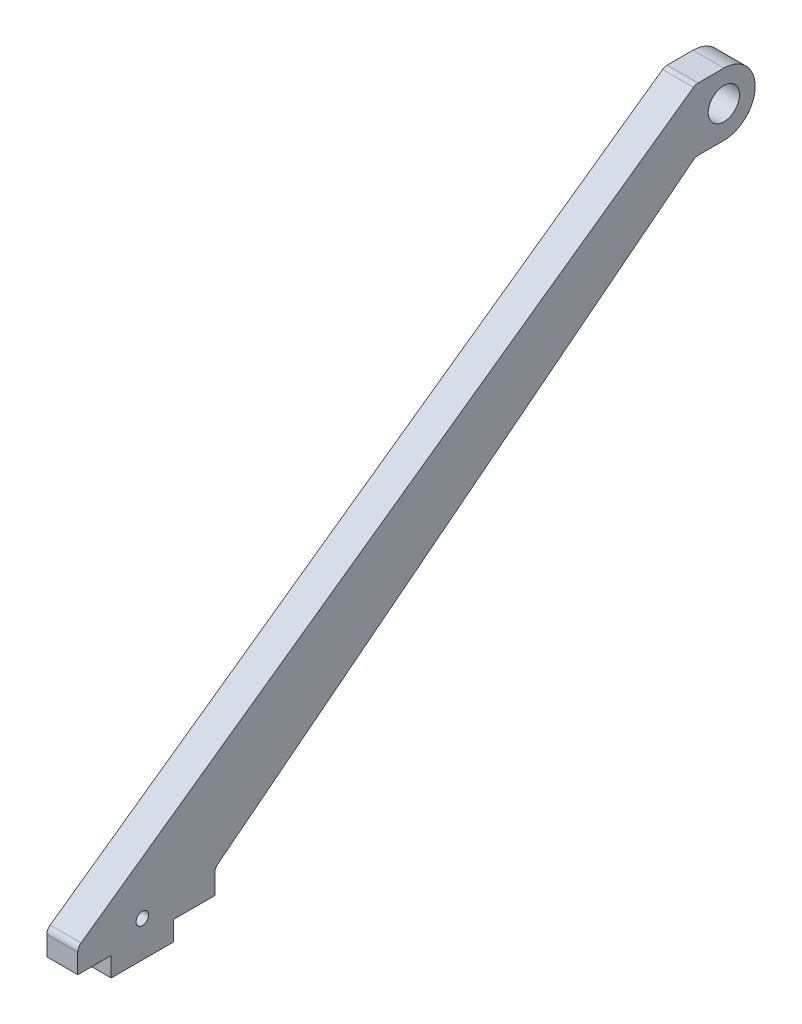
ISO-10303-21;
HEADER;
FILE_DESCRIPTION(('STEP AP214'),'2;1');
FILE_NAME('part.step','',(''),(''),'','','');
FILE_SCHEMA(('AUTOMOTIVE_DESIGN { 1 0 10303 214 1 1 1 1 }'));
ENDSEC;
DATA;
#1=APPLICATION_CONTEXT('core data for automotive mechanical design processes');
#2=APPLICATION_PROTOCOL_DEFINITION('international standard','automotive_design',2000,#1);
#3=PRODUCT_CONTEXT('',#1,'mechanical');
#4=PRODUCT('Part','Part','',(#3));
#5=PRODUCT_RELATED_PRODUCT_CATEGORY('part','',(#4));
#6=PRODUCT_DEFINITION_FORMATION('','',#4);
#7=PRODUCT_DEFINITION_CONTEXT('part definition',#1,'design');
#8=PRODUCT_DEFINITION('design','',#6,#7);
#9=PRODUCT_DEFINITION_SHAPE('','',#8);
#10=(LENGTH_UNIT() NAMED_UNIT(*) SI_UNIT(.MILLI.,.METRE.));
#11=(NAMED_UNIT(*) PLANE_ANGLE_UNIT() SI_UNIT($,.RADIAN.));
#12=(NAMED_UNIT(*) SI_UNIT($,.STERADIAN.) SOLID_ANGLE_UNIT());
#13=UNCERTAINTY_MEASURE_WITH_UNIT(LENGTH_MEASURE(1.E-05),#10,'distance_accuracy_value','');
#14=(GEOMETRIC_REPRESENTATION_CONTEXT(3) GLOBAL_UNCERTAINTY_ASSIGNED_CONTEXT((#13)) GLOBAL_UNIT_ASSIGNED_CONTEXT((#10,
#11,#12)) REPRESENTATION_CONTEXT('',''));
#15=CARTESIAN_POINT('',(0.,0.,0.));
#16=DIRECTION('',(0.,0.,1.));
#17=DIRECTION('',(1.,0.,0.));
#18=AXIS2_PLACEMENT_3D('',#15,#16,#17);
#19=CARTESIAN_POINT('',(7.9,1.98441657810762,-37.9609247580043));
#20=DIRECTION('',(0.,0.,1.));
#21=DIRECTION('',(0.,-1.,0.));
#22=AXIS2_PLACEMENT_3D('',#19,#20,#21);
#23=PLANE('',#22);
#24=DIRECTION('',(0.,1.,0.));
#25=VECTOR('',#24,1.);
#26=CARTESIAN_POINT('',(0.,1.98441657810762,-37.9609247580043));
#27=LINE('',#26,#25);
#28=CARTESIAN_POINT('',(0.,1.98441657810762,-37.9609247580043));
#29=VERTEX_POINT('',#28);
#30=CARTESIAN_POINT('',(0.,6.98441657810762,-37.9609247580043));
#31=VERTEX_POINT('',#30);
#32=EDGE_CURVE('E200',#29,#31,#27,.T.);
#33=ORIENTED_EDGE('',*,*,#32,.F.);
#34=DIRECTION('',(-1.,0.,0.));
#35=VECTOR('',#34,1.);
#36=CARTESIAN_POINT('',(7.9,1.98441657810762,-37.9609247580043));
#37=LINE('',#36,#35);
#38=CARTESIAN_POINT('',(7.9,1.98441657810762,-37.9609247580043));
#39=VERTEX_POINT('',#38);
#40=EDGE_CURVE('E168',#39,#29,#37,.T.);
#41=ORIENTED_EDGE('',*,*,#40,.F.);
#42=DIRECTION('',(0.,1.,0.));
#43=VECTOR('',#42,1.);
#44=CARTESIAN_POINT('',(7.9,1.98441657810762,-37.9609247580043));
#45=LINE('',#44,#43);
#46=CARTESIAN_POINT('',(7.9,6.98441657810762,-37.9609247580043));
#47=VERTEX_POINT('',#46);
#48=EDGE_CURVE('E164',#39,#47,#45,.T.);
#49=ORIENTED_EDGE('',*,*,#48,.T.);
#50=DIRECTION('',(-1.,0.,0.));
#51=VECTOR('',#50,1.);
#52=CARTESIAN_POINT('',(7.9,6.98441657810762,-37.9609247580043));
#53=LINE('',#52,#51);
#54=EDGE_CURVE('E148',#47,#31,#53,.T.);
#55=ORIENTED_EDGE('',*,*,#54,.T.);
#56=EDGE_LOOP('',(#33,#41,#49,#55));
#57=FACE_BOUND('',#56,.T.);
#58=ADVANCED_FACE('F33',(#57),#23,.T.);
#59=CARTESIAN_POINT('',(7.9,1.98441657810762,-37.9609247580043));
#60=DIRECTION('',(0.,1.,0.));
#61=DIRECTION('',(0.,0.,1.));
#62=AXIS2_PLACEMENT_3D('',#59,#60,#61);
#63=PLANE('',#62);
#64=DIRECTION('',(0.,0.,-1.));
#65=VECTOR('',#64,1.);
#66=CARTESIAN_POINT('',(0.,1.98441657810762,-37.9609247580043));
#67=LINE('',#66,#65);
#68=CARTESIAN_POINT('',(0.,1.98441657810762,-53.8609247580043));
#69=VERTEX_POINT('',#68);
#70=EDGE_CURVE('E170',#29,#69,#67,.T.);
#71=ORIENTED_EDGE('',*,*,#70,.T.);
#72=DIRECTION('',(-1.,0.,0.));
#73=VECTOR('',#72,1.);
#74=CARTESIAN_POINT('',(7.9,1.98441657810762,-53.8609247580043));
#75=LINE('',#74,#73);
#76=CARTESIAN_POINT('',(7.9,1.98441657810762,-53.8609247580043));
#77=VERTEX_POINT('',#76);
#78=EDGE_CURVE('E228',#77,#69,#75,.T.);
#79=ORIENTED_EDGE('',*,*,#78,.F.);
#80=DIRECTION('',(0.,0.,-1.));
#81=VECTOR('',#80,1.);
#82=CARTESIAN_POINT('',(7.9,1.98441657810762,-37.9609247580043));
#83=LINE('',#82,#81);
#84=EDGE_CURVE('E160',#39,#77,#83,.T.);
#85=ORIENTED_EDGE('',*,*,#84,.F.);
#86=ORIENTED_EDGE('',*,*,#40,.T.);
#87=EDGE_LOOP('',(#71,#79,#85,#86));
#88=FACE_BOUND('',#87,.T.);
#89=ADVANCED_FACE('F310',(#88),#63,.F.);
#90=CARTESIAN_POINT('',(7.9,1.98441657810762,-53.8609247580043));
#91=DIRECTION('',(0.,0.,1.));
#92=DIRECTION('',(1.,0.,0.));
#93=AXIS2_PLACEMENT_3D('',#90,#91,#92);
#94=PLANE('',#93);
#95=DIRECTION('',(0.,1.,0.));
#96=VECTOR('',#95,1.);
#97=CARTESIAN_POINT('',(0.,1.98441657810762,-53.8609247580043));
#98=LINE('',#97,#96);
#99=CARTESIAN_POINT('',(0.,6.98441657810762,-53.8609247580043));
#100=VERTEX_POINT('',#99);
#101=EDGE_CURVE('E172',#69,#100,#98,.T.);
#102=ORIENTED_EDGE('',*,*,#101,.T.);
#103=DIRECTION('',(-1.,0.,0.));
#104=VECTOR('',#103,1.);
#105=CARTESIAN_POINT('',(7.9,6.98441657810762,-53.8609247580043));
#106=LINE('',#105,#104);
#107=CARTESIAN_POINT('',(7.9,6.98441657810762,-53.8609247580043));
#108=VERTEX_POINT('',#107);
#109=EDGE_CURVE('E231',#108,#100,#106,.T.);
#110=ORIENTED_EDGE('',*,*,#109,.F.);
#111=DIRECTION('',(0.,1.,0.));
#112=VECTOR('',#111,1.);
#113=CARTESIAN_POINT('',(7.9,1.98441657810762,-53.8609247580043));
#114=LINE('',#113,#112);
#115=EDGE_CURVE('E197',#77,#108,#114,.T.);
#116=ORIENTED_EDGE('',*,*,#115,.F.);
#117=ORIENTED_EDGE('',*,*,#78,.T.);
#118=EDGE_LOOP('',(#102,#110,#116,#117));
#119=FACE_BOUND('',#118,.T.);
#120=ADVANCED_FACE('F313',(#119),#94,.F.);
#121=CARTESIAN_POINT('',(7.9,6.98441657810762,-53.8609247580043));
#122=DIRECTION('',(0.,1.,0.));
#123=DIRECTION('',(0.,0.,1.));
#124=AXIS2_PLACEMENT_3D('',#121,#122,#123);
#125=PLANE('',#124);
#126=DIRECTION('',(0.,0.,-1.));
#127=VECTOR('',#126,1.);
#128=CARTESIAN_POINT('',(0.,6.98441657810762,-53.8609247580043));
#129=LINE('',#128,#127);
#130=CARTESIAN_POINT('',(0.,6.98441657810762,-64.4109247580044));
#131=VERTEX_POINT('',#130);
#132=EDGE_CURVE('E223',#100,#131,#129,.T.);
#133=ORIENTED_EDGE('',*,*,#132,.T.);
#134=DIRECTION('',(-1.,0.,0.));
#135=VECTOR('',#134,1.);
#136=CARTESIAN_POINT('',(7.9,6.98441657810762,-64.4109247580044));
#137=LINE('',#136,#135);
#138=CARTESIAN_POINT('',(7.9,6.98441657810762,-64.4109247580044));
#139=VERTEX_POINT('',#138);
#140=EDGE_CURVE('E234',#139,#131,#137,.T.);
#141=ORIENTED_EDGE('',*,*,#140,.F.);
#142=DIRECTION('',(0.,0.,-1.));
#143=VECTOR('',#142,1.);
#144=CARTESIAN_POINT('',(7.9,6.98441657810762,-53.8609247580043));
#145=LINE('',#144,#143);
#146=EDGE_CURVE('E195',#108,#139,#145,.T.);
#147=ORIENTED_EDGE('',*,*,#146,.F.);
#148=ORIENTED_EDGE('',*,*,#109,.T.);
#149=EDGE_LOOP('',(#133,#141,#147,#148));
#150=FACE_BOUND('',#149,.T.);
#151=ADVANCED_FACE('F320',(#150),#125,.F.);
#152=CARTESIAN_POINT('',(7.9,6.98441657810762,-64.4109247580044));
#153=DIRECTION('',(0.,0.,1.));
#154=DIRECTION('',(1.,0.,0.));
#155=AXIS2_PLACEMENT_3D('',#152,#153,#154);
#156=PLANE('',#155);
#157=DIRECTION('',(0.,1.,0.));
#158=VECTOR('',#157,1.);
#159=CARTESIAN_POINT('',(0.,6.98441657810762,-64.4109247580044));
#160=LINE('',#159,#158);
#161=CARTESIAN_POINT('',(0.,12.0094883647217,-64.4109247580044));
#162=VERTEX_POINT('',#161);
#163=EDGE_CURVE('E220',#131,#162,#160,.T.);
#164=ORIENTED_EDGE('',*,*,#163,.T.);
#165=DIRECTION('',(-1.,0.,0.));
#166=VECTOR('',#165,1.);
#167=CARTESIAN_POINT('',(7.9,12.0094883647217,-64.4109247580044));
#168=LINE('',#167,#166);
#169=CARTESIAN_POINT('',(7.9,12.0094883647217,-64.4109247580044));
#170=VERTEX_POINT('',#169);
#171=EDGE_CURVE('E246',#162,#170,#168,.F.);
#172=ORIENTED_EDGE('',*,*,#171,.T.);
#173=DIRECTION('',(0.,1.,0.));
#174=VECTOR('',#173,1.);
#175=CARTESIAN_POINT('',(7.9,6.98441657810762,-64.4109247580044));
#176=LINE('',#175,#174);
#177=EDGE_CURVE('E192',#139,#170,#176,.T.);
#178=ORIENTED_EDGE('',*,*,#177,.F.);
#179=ORIENTED_EDGE('',*,*,#140,.T.);
#180=EDGE_LOOP('',(#164,#172,#178,#179));
#181=FACE_BOUND('',#180,.T.);
#182=ADVANCED_FACE('F323',(#181),#156,.F.);
#183=CARTESIAN_POINT('',(7.9,12.9844165781076,-64.4109247580044));
#184=DIRECTION('',(0.,0.787743592152993,0.616003273548038));
#185=DIRECTION('',(0.,-0.616003273548038,0.787743592152993));
#186=AXIS2_PLACEMENT_3D('',#183,#184,#185);
#187=PLANE('',#186);
#188=DIRECTION('',(0.,0.616003273548038,-0.787743592152993));
#189=VECTOR('',#188,1.);
#190=CARTESIAN_POINT('',(7.9,12.9844165781076,-64.4109247580044));
#191=LINE('',#190,#189);
#192=CARTESIAN_POINT('',(7.9,13.5849755490277,-65.1789182109083));
#193=VERTEX_POINT('',#192);
#194=CARTESIAN_POINT('',(7.9,108.559903762414,-186.632641475012));
#195=VERTEX_POINT('',#194);
#196=EDGE_CURVE('E189',#193,#195,#191,.T.);
#197=ORIENTED_EDGE('',*,*,#196,.F.);
#198=DIRECTION('',(-1.,0.,0.));
#199=VECTOR('',#198,1.);
#200=CARTESIAN_POINT('',(0.,13.5849755490277,-65.1789182109083));
#201=LINE('',#200,#199);
#202=CARTESIAN_POINT('',(0.,13.5849755490277,-65.1789182109083));
#203=VERTEX_POINT('',#202);
#204=EDGE_CURVE('E243',#193,#203,#201,.T.);
#205=ORIENTED_EDGE('',*,*,#204,.T.);
#206=DIRECTION('',(0.,0.616003273548038,-0.787743592152993));
#207=VECTOR('',#206,1.);
#208=CARTESIAN_POINT('',(0.,12.9844165781076,-64.4109247580044));
#209=LINE('',#208,#207);
#210=CARTESIAN_POINT('',(0.,108.559903762414,-186.632641475012));
#211=VERTEX_POINT('',#210);
#212=EDGE_CURVE('E217',#203,#211,#209,.T.);
#213=ORIENTED_EDGE('',*,*,#212,.T.);
#214=DIRECTION('',(-1.,0.,0.));
#215=VECTOR('',#214,1.);
#216=CARTESIAN_POINT('',(7.9,108.559903762414,-186.632641475012));
#217=LINE('',#216,#215);
#218=EDGE_CURVE('E227',#211,#195,#217,.F.);
#219=ORIENTED_EDGE('',*,*,#218,.T.);
#220=EDGE_LOOP('',(#197,#205,#213,#219));
#221=FACE_BOUND('',#220,.T.);
#222=ADVANCED_FACE('F280',(#221),#187,.F.);
#223=CARTESIAN_POINT('',(7.9,108.984416578108,-194.410924758004));
#224=DIRECTION('',(0.,-1.,0.));
#225=DIRECTION('',(0.,0.,-1.));
#226=AXIS2_PLACEMENT_3D('',#223,#224,#225);
#227=PLANE('',#226);
#228=DIRECTION('',(0.,0.,1.));
#229=VECTOR('',#228,1.);
#230=CARTESIAN_POINT('',(7.9,108.984416578108,-194.410924758004));
#231=LINE('',#230,#229);
#232=CARTESIAN_POINT('',(7.9,108.984416578108,-194.410924758004));
#233=VERTEX_POINT('',#232);
#234=CARTESIAN_POINT('',(7.9,108.984416578108,-187.864648022108));
#235=VERTEX_POINT('',#234);
#236=EDGE_CURVE('E186',#233,#235,#231,.T.);
#237=ORIENTED_EDGE('',*,*,#236,.T.);
#238=DIRECTION('',(-1.,0.,0.));
#239=VECTOR('',#238,1.);
#240=CARTESIAN_POINT('',(7.9,108.984416578108,-187.864648022108));
#241=LINE('',#240,#239);
#242=CARTESIAN_POINT('',(0.,108.984416578108,-187.864648022108));
#243=VERTEX_POINT('',#242);
#244=EDGE_CURVE('E248',#235,#243,#241,.T.);
#245=ORIENTED_EDGE('',*,*,#244,.T.);
#246=DIRECTION('',(0.,0.,1.));
#247=VECTOR('',#246,1.);
#248=CARTESIAN_POINT('',(0.,108.984416578108,-194.410924758004));
#249=LINE('',#248,#247);
#250=CARTESIAN_POINT('',(0.,108.984416578108,-194.410924758004));
#251=VERTEX_POINT('',#250);
#252=EDGE_CURVE('E214',#251,#243,#249,.T.);
#253=ORIENTED_EDGE('',*,*,#252,.F.);
#254=DIRECTION('',(-1.,0.,0.));
#255=VECTOR('',#254,1.);
#256=CARTESIAN_POINT('',(7.9,108.984416578108,-194.410924758004));
#257=LINE('',#256,#255);
#258=EDGE_CURVE('E237',#233,#251,#257,.T.);
#259=ORIENTED_EDGE('',*,*,#258,.F.);
#260=EDGE_LOOP('',(#237,#245,#253,#259));
#261=FACE_BOUND('',#260,.T.);
#262=ADVANCED_FACE('F287',(#261),#227,.T.);
#263=CARTESIAN_POINT('',(7.9,116.984416578108,-194.410924758004));
#264=DIRECTION('',(-1.,0.,0.));
#265=DIRECTION('',(0.,0.,1.));
#266=AXIS2_PLACEMENT_3D('',#263,#264,#265);
#267=CYLINDRICAL_SURFACE('',#266,8.);
#268=CARTESIAN_POINT('',(0.,116.984416578108,-194.410924758004));
#269=DIRECTION('',(-1.,0.,0.));
#270=DIRECTION('',(0.,0.,1.));
#271=AXIS2_PLACEMENT_3D('',#268,#269,#270);
#272=CIRCLE('',#271,8.);
#273=CARTESIAN_POINT('',(0.,124.984416578108,-194.410924758004));
#274=VERTEX_POINT('',#273);
#275=EDGE_CURVE('E211',#274,#251,#272,.T.);
#276=ORIENTED_EDGE('',*,*,#275,.F.);
#277=DIRECTION('',(-1.,0.,0.));
#278=VECTOR('',#277,1.);
#279=CARTESIAN_POINT('',(7.9,124.984416578108,-194.410924758004));
#280=LINE('',#279,#278);
#281=CARTESIAN_POINT('',(7.9,124.984416578108,-194.410924758004));
#282=VERTEX_POINT('',#281);
#283=EDGE_CURVE('E239',#282,#274,#280,.T.);
#284=ORIENTED_EDGE('',*,*,#283,.F.);
#285=CARTESIAN_POINT('',(7.9,116.984416578108,-194.410924758004));
#286=DIRECTION('',(-1.,0.,0.));
#287=DIRECTION('',(0.,0.,1.));
#288=AXIS2_PLACEMENT_3D('',#285,#286,#287);
#289=CIRCLE('',#288,8.);
#290=EDGE_CURVE('E183',#282,#233,#289,.T.);
#291=ORIENTED_EDGE('',*,*,#290,.T.);
#292=ORIENTED_EDGE('',*,*,#258,.T.);
#293=EDGE_LOOP('',(#276,#284,#291,#292));
#294=FACE_BOUND('',#293,.T.);
#295=ADVANCED_FACE('F290',(#294),#267,.T.);
#296=CARTESIAN_POINT('',(7.9,124.984416578108,-194.410924758004));
#297=DIRECTION('',(0.,-1.,0.));
#298=DIRECTION('',(0.,0.,-1.));
#299=AXIS2_PLACEMENT_3D('',#296,#297,#298);
#300=PLANE('',#299);
#301=DIRECTION('',(0.,0.,1.));
#302=VECTOR('',#301,1.);
#303=CARTESIAN_POINT('',(0.,124.984416578108,-194.410924758004));
#304=LINE('',#303,#302);
#305=CARTESIAN_POINT('',(0.,124.984416578108,-187.81324373198));
#306=VERTEX_POINT('',#305);
#307=EDGE_CURVE('E209',#274,#306,#304,.T.);
#308=ORIENTED_EDGE('',*,*,#307,.T.);
#309=DIRECTION('',(-1.,0.,0.));
#310=VECTOR('',#309,1.);
#311=CARTESIAN_POINT('',(7.9,124.984416578108,-187.81324373198));
#312=LINE('',#311,#310);
#313=CARTESIAN_POINT('',(7.9,124.984416578108,-187.81324373198));
#314=VERTEX_POINT('',#313);
#315=EDGE_CURVE('E56',#306,#314,#312,.F.);
#316=ORIENTED_EDGE('',*,*,#315,.T.);
#317=DIRECTION('',(0.,0.,1.));
#318=VECTOR('',#317,1.);
#319=CARTESIAN_POINT('',(7.9,124.984416578108,-194.410924758004));
#320=LINE('',#319,#318);
#321=EDGE_CURVE('E181',#282,#314,#320,.T.);
#322=ORIENTED_EDGE('',*,*,#321,.F.);
#323=ORIENTED_EDGE('',*,*,#283,.T.);
#324=EDGE_LOOP('',(#308,#316,#322,#323));
#325=FACE_BOUND('',#324,.T.);
#326=ADVANCED_FACE('F351',(#325),#300,.F.);
#327=CARTESIAN_POINT('',(7.9,124.984416578108,-187.175507503018));
#328=DIRECTION('',(0.,-0.815414343729439,-0.578877748786641));
#329=DIRECTION('',(0.,0.578877748786641,-0.815414343729439));
#330=AXIS2_PLACEMENT_3D('',#327,#328,#329);
#331=PLANE('',#330);
#332=DIRECTION('',(0.,-0.578877748786641,0.815414343729439));
#333=VECTOR('',#332,1.);
#334=CARTESIAN_POINT('',(7.9,124.984416578108,-187.175507503018));
#335=LINE('',#334,#333);
#336=CARTESIAN_POINT('',(7.9,124.615245265567,-186.655488234406));
#337=VERTEX_POINT('',#336);
#338=CARTESIAN_POINT('',(7.9,13.5823415536026,-30.253169260431));
#339=VERTEX_POINT('',#338);
#340=EDGE_CURVE('E179',#337,#339,#335,.T.);
#341=ORIENTED_EDGE('',*,*,#340,.F.);
#342=DIRECTION('',(-1.,0.,0.));
#343=VECTOR('',#342,1.);
#344=CARTESIAN_POINT('',(7.9,124.615245265567,-186.655488234406));
#345=LINE('',#344,#343);
#346=CARTESIAN_POINT('',(0.,124.615245265567,-186.655488234406));
#347=VERTEX_POINT('',#346);
#348=EDGE_CURVE('E253',#337,#347,#345,.T.);
#349=ORIENTED_EDGE('',*,*,#348,.T.);
#350=DIRECTION('',(0.,-0.578877748786641,0.815414343729439));
#351=VECTOR('',#350,1.);
#352=CARTESIAN_POINT('',(0.,124.984416578108,-187.175507503018));
#353=LINE('',#352,#351);
#354=CARTESIAN_POINT('',(0.,13.5823415536026,-30.253169260431));
#355=VERTEX_POINT('',#354);
#356=EDGE_CURVE('E206',#347,#355,#353,.T.);
#357=ORIENTED_EDGE('',*,*,#356,.T.);
#358=DIRECTION('',(-1.,0.,0.));
#359=VECTOR('',#358,1.);
#360=CARTESIAN_POINT('',(7.9,13.5823415536026,-30.253169260431));
#361=LINE('',#360,#359);
#362=EDGE_CURVE('E251',#355,#339,#361,.F.);
#363=ORIENTED_EDGE('',*,*,#362,.T.);
#364=EDGE_LOOP('',(#341,#349,#357,#363));
#365=FACE_BOUND('',#364,.T.);
#366=ADVANCED_FACE('F297',(#365),#331,.F.);
#367=CARTESIAN_POINT('',(7.9,12.9844165781076,-29.4109247580043));
#368=DIRECTION('',(0.,0.,-1.));
#369=DIRECTION('',(-1.,0.,0.));
#370=AXIS2_PLACEMENT_3D('',#367,#368,#369);
#371=PLANE('',#370);
#372=DIRECTION('',(0.,-1.,0.));
#373=VECTOR('',#372,1.);
#374=CARTESIAN_POINT('',(7.9,12.9844165781076,-29.4109247580043));
#375=LINE('',#374,#373);
#376=CARTESIAN_POINT('',(7.9,11.9515128661438,-29.4109247580043));
#377=VERTEX_POINT('',#376);
#378=CARTESIAN_POINT('',(7.9,6.98441657810762,-29.4109247580043));
#379=VERTEX_POINT('',#378);
#380=EDGE_CURVE('E165',#377,#379,#375,.T.);
#381=ORIENTED_EDGE('',*,*,#380,.F.);
#382=DIRECTION('',(-1.,0.,0.));
#383=VECTOR('',#382,1.);
#384=CARTESIAN_POINT('',(7.9,11.9515128661438,-29.4109247580043));
#385=LINE('',#384,#383);
#386=CARTESIAN_POINT('',(0.,11.9515128661438,-29.4109247580043));
#387=VERTEX_POINT('',#386);
#388=EDGE_CURVE('E264',#377,#387,#385,.T.);
#389=ORIENTED_EDGE('',*,*,#388,.T.);
#390=DIRECTION('',(0.,-1.,0.));
#391=VECTOR('',#390,1.);
#392=CARTESIAN_POINT('',(0.,12.9844165781076,-29.4109247580043));
#393=LINE('',#392,#391);
#394=CARTESIAN_POINT('',(0.,6.98441657810762,-29.4109247580043));
#395=VERTEX_POINT('',#394);
#396=EDGE_CURVE('E204',#387,#395,#393,.T.);
#397=ORIENTED_EDGE('',*,*,#396,.T.);
#398=DIRECTION('',(-1.,0.,0.));
#399=VECTOR('',#398,1.);
#400=CARTESIAN_POINT('',(7.9,6.98441657810762,-29.4109247580043));
#401=LINE('',#400,#399);
#402=EDGE_CURVE('E159',#379,#395,#401,.T.);
#403=ORIENTED_EDGE('',*,*,#402,.F.);
#404=EDGE_LOOP('',(#381,#389,#397,#403));
#405=FACE_BOUND('',#404,.T.);
#406=ADVANCED_FACE('F304',(#405),#371,.F.);
#407=CARTESIAN_POINT('',(7.9,6.98441657810762,-37.9609247580043));
#408=DIRECTION('',(0.,-1.,0.));
#409=DIRECTION('',(0.,0.,-1.));
#410=AXIS2_PLACEMENT_3D('',#407,#408,#409);
#411=PLANE('',#410);
#412=DIRECTION('',(0.,0.,1.));
#413=VECTOR('',#412,1.);
#414=CARTESIAN_POINT('',(0.,6.98441657810762,-37.9609247580043));
#415=LINE('',#414,#413);
#416=EDGE_CURVE('E154',#31,#395,#415,.T.);
#417=ORIENTED_EDGE('',*,*,#416,.F.);
#418=ORIENTED_EDGE('',*,*,#54,.F.);
#419=DIRECTION('',(0.,0.,1.));
#420=VECTOR('',#419,1.);
#421=CARTESIAN_POINT('',(7.9,6.98441657810762,-37.9609247580043));
#422=LINE('',#421,#420);
#423=EDGE_CURVE('E152',#47,#379,#422,.T.);
#424=ORIENTED_EDGE('',*,*,#423,.T.);
#425=ORIENTED_EDGE('',*,*,#402,.T.);
#426=EDGE_LOOP('',(#417,#418,#424,#425));
#427=FACE_BOUND('',#426,.T.);
#428=ADVANCED_FACE('F150',(#427),#411,.T.);
#429=CARTESIAN_POINT('',(7.9,116.984416578108,-194.410924758004));
#430=DIRECTION('',(-1.,0.,0.));
#431=DIRECTION('',(0.,0.,1.));
#432=AXIS2_PLACEMENT_3D('',#429,#430,#431);
#433=PLANE('',#432);
#434=CARTESIAN_POINT('',(7.9,117.118890011223,-194.410924758004));
#435=DIRECTION('',(1.,0.,0.));
#436=DIRECTION('',(0.,0.,-1.));
#437=AXIS2_PLACEMENT_3D('',#434,#435,#436);
#438=CIRCLE('',#437,3.99999999999999);
#439=CARTESIAN_POINT('',(7.9,117.118890011223,-198.410924758004));
#440=VERTEX_POINT('',#439);
#441=EDGE_CURVE('E384',#440,#440,#438,.T.);
#442=ORIENTED_EDGE('',*,*,#441,.F.);
#443=EDGE_LOOP('',(#442));
#444=FACE_BOUND('',#443,.T.);
#445=CARTESIAN_POINT('',(7.9,11.1844165781076,-45.9109247580044));
#446=DIRECTION('',(1.,0.,0.));
#447=DIRECTION('',(0.,0.,-1.));
#448=AXIS2_PLACEMENT_3D('',#445,#446,#447);
#449=CIRCLE('',#448,1.6);
#450=CARTESIAN_POINT('',(7.9,11.1844165781076,-47.5109247580044));
#451=VERTEX_POINT('',#450);
#452=EDGE_CURVE('E175',#451,#451,#449,.T.);
#453=ORIENTED_EDGE('',*,*,#452,.F.);
#454=EDGE_LOOP('',(#453));
#455=FACE_BOUND('',#454,.T.);
#456=ORIENTED_EDGE('',*,*,#321,.T.);
#457=CARTESIAN_POINT('',(7.9,122.984416578108,-187.81324373198));
#458=DIRECTION('',(-1.,0.,0.));
#459=DIRECTION('',(0.,0.,1.));
#460=AXIS2_PLACEMENT_3D('',#457,#458,#459);
#461=CIRCLE('',#460,2.);
#462=EDGE_CURVE('E262',#314,#337,#461,.F.);
#463=ORIENTED_EDGE('',*,*,#462,.T.);
#464=ORIENTED_EDGE('',*,*,#340,.T.);
#465=CARTESIAN_POINT('',(7.9,11.9515128661438,-31.4109247580043));
#466=DIRECTION('',(-1.,0.,0.));
#467=DIRECTION('',(0.,0.,1.));
#468=AXIS2_PLACEMENT_3D('',#465,#466,#467);
#469=CIRCLE('',#468,2.);
#470=EDGE_CURVE('E48',#339,#377,#469,.F.);
#471=ORIENTED_EDGE('',*,*,#470,.T.);
#472=ORIENTED_EDGE('',*,*,#380,.T.);
#473=ORIENTED_EDGE('',*,*,#423,.F.);
#474=ORIENTED_EDGE('',*,*,#48,.F.);
#475=ORIENTED_EDGE('',*,*,#84,.T.);
#476=ORIENTED_EDGE('',*,*,#115,.T.);
#477=ORIENTED_EDGE('',*,*,#146,.T.);
#478=ORIENTED_EDGE('',*,*,#177,.T.);
#479=CARTESIAN_POINT('',(7.9,12.0094883647217,-66.4109247580044));
#480=DIRECTION('',(-1.,0.,0.));
#481=DIRECTION('',(0.,0.,1.));
#482=AXIS2_PLACEMENT_3D('',#479,#480,#481);
#483=CIRCLE('',#482,2.);
#484=EDGE_CURVE('E269',#170,#193,#483,.T.);
#485=ORIENTED_EDGE('',*,*,#484,.T.);
#486=ORIENTED_EDGE('',*,*,#196,.T.);
#487=CARTESIAN_POINT('',(7.9,106.984416578108,-187.864648022108));
#488=DIRECTION('',(-1.,0.,0.));
#489=DIRECTION('',(0.,0.,1.));
#490=AXIS2_PLACEMENT_3D('',#487,#488,#489);
#491=CIRCLE('',#490,2.);
#492=EDGE_CURVE('E11',#195,#235,#491,.T.);
#493=ORIENTED_EDGE('',*,*,#492,.T.);
#494=ORIENTED_EDGE('',*,*,#236,.F.);
#495=ORIENTED_EDGE('',*,*,#290,.F.);
#496=EDGE_LOOP('',(#456,#463,#464,#471,#472,#473,#474,#475,#476,#477,#478,#485,#486,#493,#494,#495));
#497=FACE_BOUND('',#496,.T.);
#498=ADVANCED_FACE('F163',(#444,#455,#497),#433,.F.);
#499=CARTESIAN_POINT('',(0.,116.984416578108,-194.410924758004));
#500=DIRECTION('',(-1.,0.,0.));
#501=DIRECTION('',(0.,0.,1.));
#502=AXIS2_PLACEMENT_3D('',#499,#500,#501);
#503=PLANE('',#502);
#504=CARTESIAN_POINT('',(0.,117.118890011223,-194.410924758004));
#505=DIRECTION('',(1.,0.,0.));
#506=DIRECTION('',(0.,0.,-1.));
#507=AXIS2_PLACEMENT_3D('',#504,#505,#506);
#508=CIRCLE('',#507,3.99999999999999);
#509=CARTESIAN_POINT('',(0.,117.118890011223,-198.410924758004));
#510=VERTEX_POINT('',#509);
#511=EDGE_CURVE('E382',#510,#510,#508,.T.);
#512=ORIENTED_EDGE('',*,*,#511,.T.);
#513=EDGE_LOOP('',(#512));
#514=FACE_BOUND('',#513,.T.);
#515=CARTESIAN_POINT('',(0.,11.1844165781076,-45.9109247580044));
#516=DIRECTION('',(1.,0.,0.));
#517=DIRECTION('',(0.,0.,-1.));
#518=AXIS2_PLACEMENT_3D('',#515,#516,#517);
#519=CIRCLE('',#518,1.6);
#520=CARTESIAN_POINT('',(0.,11.1844165781076,-47.5109247580044));
#521=VERTEX_POINT('',#520);
#522=EDGE_CURVE('E202',#521,#521,#519,.T.);
#523=ORIENTED_EDGE('',*,*,#522,.T.);
#524=EDGE_LOOP('',(#523));
#525=FACE_BOUND('',#524,.T.);
#526=ORIENTED_EDGE('',*,*,#356,.F.);
#527=CARTESIAN_POINT('',(0.,122.984416578108,-187.81324373198));
#528=DIRECTION('',(-1.,0.,0.));
#529=DIRECTION('',(0.,0.,1.));
#530=AXIS2_PLACEMENT_3D('',#527,#528,#529);
#531=CIRCLE('',#530,2.);
#532=EDGE_CURVE('E258',#347,#306,#531,.T.);
#533=ORIENTED_EDGE('',*,*,#532,.T.);
#534=ORIENTED_EDGE('',*,*,#307,.F.);
#535=ORIENTED_EDGE('',*,*,#275,.T.);
#536=ORIENTED_EDGE('',*,*,#252,.T.);
#537=CARTESIAN_POINT('',(0.,106.984416578108,-187.864648022108));
#538=DIRECTION('',(-1.,0.,0.));
#539=DIRECTION('',(0.,0.,1.));
#540=AXIS2_PLACEMENT_3D('',#537,#538,#539);
#541=CIRCLE('',#540,2.);
#542=EDGE_CURVE('E41',#243,#211,#541,.F.);
#543=ORIENTED_EDGE('',*,*,#542,.T.);
#544=ORIENTED_EDGE('',*,*,#212,.F.);
#545=CARTESIAN_POINT('',(0.,12.0094883647217,-66.4109247580044));
#546=DIRECTION('',(-1.,0.,0.));
#547=DIRECTION('',(0.,0.,1.));
#548=AXIS2_PLACEMENT_3D('',#545,#546,#547);
#549=CIRCLE('',#548,2.);
#550=EDGE_CURVE('E267',#203,#162,#549,.F.);
#551=ORIENTED_EDGE('',*,*,#550,.T.);
#552=ORIENTED_EDGE('',*,*,#163,.F.);
#553=ORIENTED_EDGE('',*,*,#132,.F.);
#554=ORIENTED_EDGE('',*,*,#101,.F.);
#555=ORIENTED_EDGE('',*,*,#70,.F.);
#556=ORIENTED_EDGE('',*,*,#32,.T.);
#557=ORIENTED_EDGE('',*,*,#416,.T.);
#558=ORIENTED_EDGE('',*,*,#396,.F.);
#559=CARTESIAN_POINT('',(0.,11.9515128661438,-31.4109247580043));
#560=DIRECTION('',(-1.,0.,0.));
#561=DIRECTION('',(0.,0.,1.));
#562=AXIS2_PLACEMENT_3D('',#559,#560,#561);
#563=CIRCLE('',#562,2.);
#564=EDGE_CURVE('E256',#387,#355,#563,.T.);
#565=ORIENTED_EDGE('',*,*,#564,.T.);
#566=EDGE_LOOP('',(#526,#533,#534,#535,#536,#543,#544,#551,#552,#553,#554,#555,#556,#557,#558,#565));
#567=FACE_BOUND('',#566,.T.);
#568=ADVANCED_FACE('F273',(#514,#525,#567),#503,.T.);
#569=CARTESIAN_POINT('',(0.,11.1844165781076,-45.9109247580044));
#570=DIRECTION('',(1.,0.,0.));
#571=DIRECTION('',(0.,0.,-1.));
#572=AXIS2_PLACEMENT_3D('',#569,#570,#571);
#573=CYLINDRICAL_SURFACE('',#572,1.6);
#574=ORIENTED_EDGE('',*,*,#522,.F.);
#575=EDGE_LOOP('',(#574));
#576=FACE_BOUND('',#575,.T.);
#577=ORIENTED_EDGE('',*,*,#452,.T.);
#578=EDGE_LOOP('',(#577));
#579=FACE_BOUND('',#578,.T.);
#580=ADVANCED_FACE('F335',(#576,#579),#573,.F.);
#581=CARTESIAN_POINT('',(0.,117.118890011223,-194.410924758004));
#582=DIRECTION('',(1.,0.,0.));
#583=DIRECTION('',(0.,0.,-1.));
#584=AXIS2_PLACEMENT_3D('',#581,#582,#583);
#585=CYLINDRICAL_SURFACE('',#584,3.99999999999999);
#586=ORIENTED_EDGE('',*,*,#511,.F.);
#587=EDGE_LOOP('',(#586));
#588=FACE_BOUND('',#587,.T.);
#589=ORIENTED_EDGE('',*,*,#441,.T.);
#590=EDGE_LOOP('',(#589));
#591=FACE_BOUND('',#590,.T.);
#592=ADVANCED_FACE('F328',(#588,#591),#585,.F.);
#593=CARTESIAN_POINT('',(7.9,12.0094883647217,-66.4109247580044));
#594=DIRECTION('',(1.,0.,0.));
#595=DIRECTION('',(0.,0.,-1.));
#596=AXIS2_PLACEMENT_3D('',#593,#594,#595);
#597=CYLINDRICAL_SURFACE('',#596,2.);
#598=ORIENTED_EDGE('',*,*,#484,.F.);
#599=ORIENTED_EDGE('',*,*,#171,.F.);
#600=ORIENTED_EDGE('',*,*,#550,.F.);
#601=ORIENTED_EDGE('',*,*,#204,.F.);
#602=EDGE_LOOP('',(#598,#599,#600,#601));
#603=FACE_BOUND('',#602,.T.);
#604=ADVANCED_FACE('F326',(#603),#597,.F.);
#605=CARTESIAN_POINT('',(7.9,106.984416578108,-187.864648022108));
#606=DIRECTION('',(-1.,0.,0.));
#607=DIRECTION('',(0.,0.,1.));
#608=AXIS2_PLACEMENT_3D('',#605,#606,#607);
#609=CYLINDRICAL_SURFACE('',#608,2.);
#610=ORIENTED_EDGE('',*,*,#492,.F.);
#611=ORIENTED_EDGE('',*,*,#218,.F.);
#612=ORIENTED_EDGE('',*,*,#542,.F.);
#613=ORIENTED_EDGE('',*,*,#244,.F.);
#614=EDGE_LOOP('',(#610,#611,#612,#613));
#615=FACE_BOUND('',#614,.T.);
#616=ADVANCED_FACE('F283',(#615),#609,.F.);
#617=CARTESIAN_POINT('',(7.9,122.984416578108,-187.81324373198));
#618=DIRECTION('',(-1.,0.,0.));
#619=DIRECTION('',(0.,0.,1.));
#620=AXIS2_PLACEMENT_3D('',#617,#618,#619);
#621=CYLINDRICAL_SURFACE('',#620,2.);
#622=ORIENTED_EDGE('',*,*,#462,.F.);
#623=ORIENTED_EDGE('',*,*,#315,.F.);
#624=ORIENTED_EDGE('',*,*,#532,.F.);
#625=ORIENTED_EDGE('',*,*,#348,.F.);
#626=EDGE_LOOP('',(#622,#623,#624,#625));
#627=FACE_BOUND('',#626,.T.);
#628=ADVANCED_FACE('F295',(#627),#621,.T.);
#629=CARTESIAN_POINT('',(7.9,11.9515128661438,-31.4109247580043));
#630=DIRECTION('',(-1.,0.,0.));
#631=DIRECTION('',(0.,0.,1.));
#632=AXIS2_PLACEMENT_3D('',#629,#630,#631);
#633=CYLINDRICAL_SURFACE('',#632,2.);
#634=ORIENTED_EDGE('',*,*,#470,.F.);
#635=ORIENTED_EDGE('',*,*,#362,.F.);
#636=ORIENTED_EDGE('',*,*,#564,.F.);
#637=ORIENTED_EDGE('',*,*,#388,.F.);
#638=EDGE_LOOP('',(#634,#635,#636,#637));
#639=FACE_BOUND('',#638,.T.);
#640=ADVANCED_FACE('F35',(#639),#633,.T.);
#641=CLOSED_SHELL('',(#58,#89,#120,#151,#182,#222,#262,#295,#326,#366,#406,#428,#498,#568,#580,
#592,#604,#616,#628,#640));
#642=MANIFOLD_SOLID_BREP('B2',#641);
#643=ADVANCED_BREP_SHAPE_REPRESENTATION('',(#18,#642),#14);
#644=SHAPE_DEFINITION_REPRESENTATION(#9,#643);
ENDSEC;
END-ISO-10303-21;
